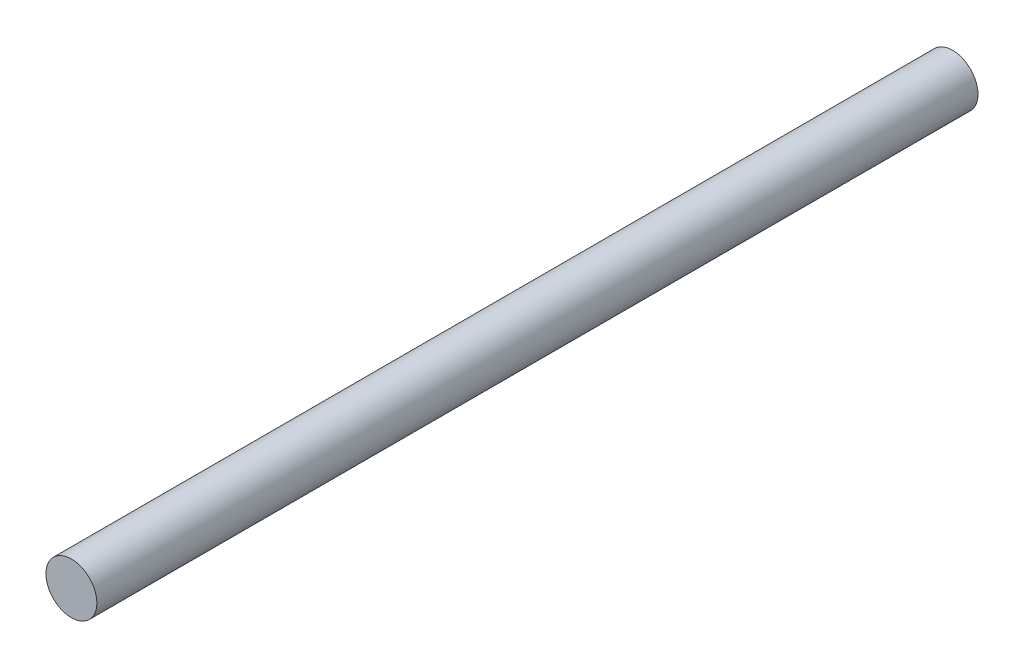
ISO-10303-21;
HEADER;
FILE_DESCRIPTION(('STEP AP214'),'2;1');
FILE_NAME('part.step','',(''),(''),'','','');
FILE_SCHEMA(('AUTOMOTIVE_DESIGN { 1 0 10303 214 1 1 1 1 }'));
ENDSEC;
DATA;
#1=APPLICATION_CONTEXT('core data for automotive mechanical design processes');
#2=APPLICATION_PROTOCOL_DEFINITION('international standard','automotive_design',2000,#1);
#3=PRODUCT_CONTEXT('',#1,'mechanical');
#4=PRODUCT('Part','Part','',(#3));
#5=PRODUCT_RELATED_PRODUCT_CATEGORY('part','',(#4));
#6=PRODUCT_DEFINITION_FORMATION('','',#4);
#7=PRODUCT_DEFINITION_CONTEXT('part definition',#1,'design');
#8=PRODUCT_DEFINITION('design','',#6,#7);
#9=PRODUCT_DEFINITION_SHAPE('','',#8);
#10=(LENGTH_UNIT() NAMED_UNIT(*) SI_UNIT(.MILLI.,.METRE.));
#11=(NAMED_UNIT(*) PLANE_ANGLE_UNIT() SI_UNIT($,.RADIAN.));
#12=(NAMED_UNIT(*) SI_UNIT($,.STERADIAN.) SOLID_ANGLE_UNIT());
#13=UNCERTAINTY_MEASURE_WITH_UNIT(LENGTH_MEASURE(1.E-05),#10,'distance_accuracy_value','');
#14=(GEOMETRIC_REPRESENTATION_CONTEXT(3) GLOBAL_UNCERTAINTY_ASSIGNED_CONTEXT((#13)) GLOBAL_UNIT_ASSIGNED_CONTEXT((#10,
#11,#12)) REPRESENTATION_CONTEXT('',''));
#15=CARTESIAN_POINT('',(0.,0.,0.));
#16=DIRECTION('',(0.,0.,1.));
#17=DIRECTION('',(1.,0.,0.));
#18=AXIS2_PLACEMENT_3D('',#15,#16,#17);
#19=CARTESIAN_POINT('',(0.,0.,45.));
#20=DIRECTION('',(0.,0.,-1.));
#21=DIRECTION('',(-1.,0.,0.));
#22=AXIS2_PLACEMENT_3D('',#19,#20,#21);
#23=CYLINDRICAL_SURFACE('',#22,1.3);
#24=CARTESIAN_POINT('',(0.,0.,45.));
#25=DIRECTION('',(0.,0.,1.));
#26=DIRECTION('',(1.,0.,0.));
#27=AXIS2_PLACEMENT_3D('',#24,#25,#26);
#28=CIRCLE('',#27,1.3);
#29=CARTESIAN_POINT('',(1.3,0.,45.));
#30=VERTEX_POINT('',#29);
#31=EDGE_CURVE('E10',#30,#30,#28,.T.);
#32=ORIENTED_EDGE('',*,*,#31,.F.);
#33=EDGE_LOOP('',(#32));
#34=FACE_BOUND('',#33,.T.);
#35=CARTESIAN_POINT('',(0.,0.,0.));
#36=DIRECTION('',(0.,0.,1.));
#37=DIRECTION('',(1.,0.,0.));
#38=AXIS2_PLACEMENT_3D('',#35,#36,#37);
#39=CIRCLE('',#38,1.3);
#40=CARTESIAN_POINT('',(1.3,0.,0.));
#41=VERTEX_POINT('',#40);
#42=EDGE_CURVE('E38',#41,#41,#39,.T.);
#43=ORIENTED_EDGE('',*,*,#42,.T.);
#44=EDGE_LOOP('',(#43));
#45=FACE_BOUND('',#44,.T.);
#46=ADVANCED_FACE('F35',(#34,#45),#23,.T.);
#47=CARTESIAN_POINT('',(0.,0.,45.));
#48=DIRECTION('',(0.,0.,1.));
#49=DIRECTION('',(1.,0.,0.));
#50=AXIS2_PLACEMENT_3D('',#47,#48,#49);
#51=PLANE('',#50);
#52=ORIENTED_EDGE('',*,*,#31,.T.);
#53=EDGE_LOOP('',(#52));
#54=FACE_BOUND('',#53,.T.);
#55=ADVANCED_FACE('F50',(#54),#51,.T.);
#56=CARTESIAN_POINT('',(0.,0.,0.));
#57=DIRECTION('',(0.,0.,1.));
#58=DIRECTION('',(1.,0.,0.));
#59=AXIS2_PLACEMENT_3D('',#56,#57,#58);
#60=PLANE('',#59);
#61=ORIENTED_EDGE('',*,*,#42,.F.);
#62=EDGE_LOOP('',(#61));
#63=FACE_BOUND('',#62,.T.);
#64=ADVANCED_FACE('F48',(#63),#60,.F.);
#65=CLOSED_SHELL('',(#46,#55,#64));
#66=MANIFOLD_SOLID_BREP('B2',#65);
#67=ADVANCED_BREP_SHAPE_REPRESENTATION('',(#18,#66),#14);
#68=SHAPE_DEFINITION_REPRESENTATION(#9,#67);
ENDSEC;
END-ISO-10303-21;
